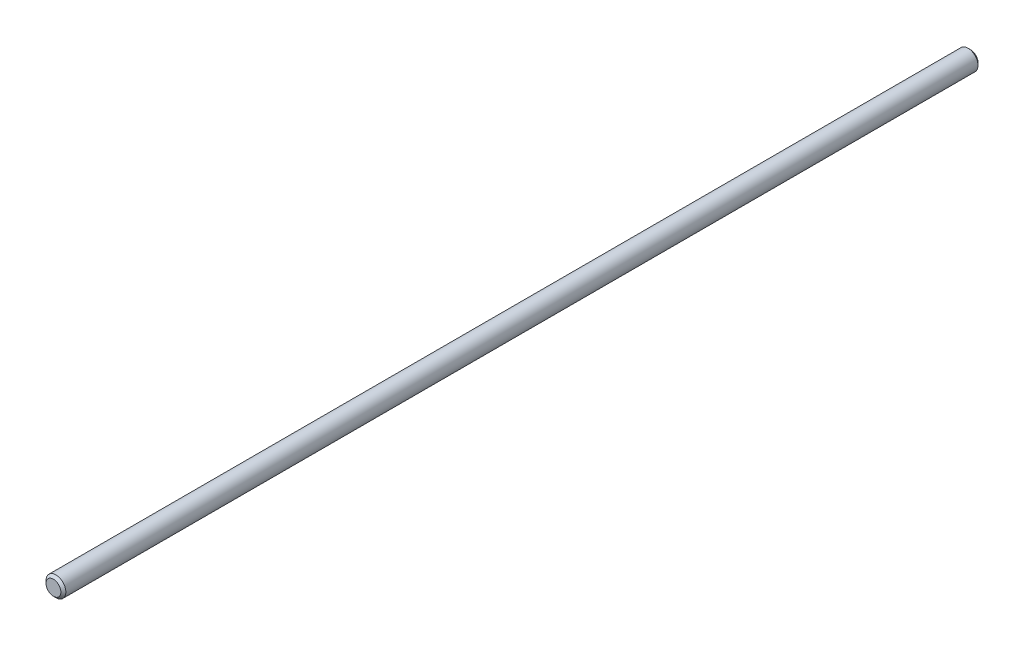
ISO-10303-21;
HEADER;
FILE_DESCRIPTION(('STEP AP214'),'2;1');
FILE_NAME('part.step','',(''),(''),'','','');
FILE_SCHEMA(('AUTOMOTIVE_DESIGN { 1 0 10303 214 1 1 1 1 }'));
ENDSEC;
DATA;
#1=APPLICATION_CONTEXT('core data for automotive mechanical design processes');
#2=APPLICATION_PROTOCOL_DEFINITION('international standard','automotive_design',2000,#1);
#3=PRODUCT_CONTEXT('',#1,'mechanical');
#4=PRODUCT('Part','Part','',(#3));
#5=PRODUCT_RELATED_PRODUCT_CATEGORY('part','',(#4));
#6=PRODUCT_DEFINITION_FORMATION('','',#4);
#7=PRODUCT_DEFINITION_CONTEXT('part definition',#1,'design');
#8=PRODUCT_DEFINITION('design','',#6,#7);
#9=PRODUCT_DEFINITION_SHAPE('','',#8);
#10=(LENGTH_UNIT() NAMED_UNIT(*) SI_UNIT(.MILLI.,.METRE.));
#11=(NAMED_UNIT(*) PLANE_ANGLE_UNIT() SI_UNIT($,.RADIAN.));
#12=(NAMED_UNIT(*) SI_UNIT($,.STERADIAN.) SOLID_ANGLE_UNIT());
#13=UNCERTAINTY_MEASURE_WITH_UNIT(LENGTH_MEASURE(1.E-05),#10,'distance_accuracy_value','');
#14=(GEOMETRIC_REPRESENTATION_CONTEXT(3) GLOBAL_UNCERTAINTY_ASSIGNED_CONTEXT((#13)) GLOBAL_UNIT_ASSIGNED_CONTEXT((#10,
#11,#12)) REPRESENTATION_CONTEXT('',''));
#15=CARTESIAN_POINT('',(0.,0.,0.));
#16=DIRECTION('',(0.,0.,1.));
#17=DIRECTION('',(1.,0.,0.));
#18=AXIS2_PLACEMENT_3D('',#15,#16,#17);
#19=CARTESIAN_POINT('',(0.,0.,370.));
#20=DIRECTION('',(0.,0.,-1.));
#21=DIRECTION('',(-1.,0.,0.));
#22=AXIS2_PLACEMENT_3D('',#19,#20,#21);
#23=CYLINDRICAL_SURFACE('',#22,4.);
#24=CARTESIAN_POINT('',(0.,0.,1.00000000000006));
#25=DIRECTION('',(0.,0.,1.));
#26=DIRECTION('',(1.,0.,0.));
#27=AXIS2_PLACEMENT_3D('',#24,#25,#26);
#28=CIRCLE('',#27,4.);
#29=CARTESIAN_POINT('',(4.,0.,1.00000000000006));
#30=VERTEX_POINT('',#29);
#31=EDGE_CURVE('E46',#30,#30,#28,.T.);
#32=ORIENTED_EDGE('',*,*,#31,.T.);
#33=EDGE_LOOP('',(#32));
#34=FACE_BOUND('',#33,.T.);
#35=CARTESIAN_POINT('',(0.,0.,369.));
#36=DIRECTION('',(0.,0.,1.));
#37=DIRECTION('',(1.,0.,0.));
#38=AXIS2_PLACEMENT_3D('',#35,#36,#37);
#39=CIRCLE('',#38,4.);
#40=CARTESIAN_POINT('',(4.,0.,369.));
#41=VERTEX_POINT('',#40);
#42=EDGE_CURVE('E50',#41,#41,#39,.F.);
#43=ORIENTED_EDGE('',*,*,#42,.T.);
#44=EDGE_LOOP('',(#43));
#45=FACE_BOUND('',#44,.T.);
#46=ADVANCED_FACE('F35',(#34,#45),#23,.T.);
#47=CARTESIAN_POINT('',(0.,0.,370.));
#48=DIRECTION('',(0.,0.,1.));
#49=DIRECTION('',(1.,0.,0.));
#50=AXIS2_PLACEMENT_3D('',#47,#48,#49);
#51=PLANE('',#50);
#52=CARTESIAN_POINT('',(0.,0.,370.));
#53=DIRECTION('',(0.,0.,1.));
#54=DIRECTION('',(1.,0.,0.));
#55=AXIS2_PLACEMENT_3D('',#52,#53,#54);
#56=CIRCLE('',#55,3.);
#57=CARTESIAN_POINT('',(3.,0.,370.));
#58=VERTEX_POINT('',#57);
#59=EDGE_CURVE('E10',#58,#58,#56,.T.);
#60=ORIENTED_EDGE('',*,*,#59,.T.);
#61=EDGE_LOOP('',(#60));
#62=FACE_BOUND('',#61,.T.);
#63=ADVANCED_FACE('F66',(#62),#51,.T.);
#64=CARTESIAN_POINT('',(0.,0.,0.));
#65=DIRECTION('',(0.,0.,1.));
#66=DIRECTION('',(1.,0.,0.));
#67=AXIS2_PLACEMENT_3D('',#64,#65,#66);
#68=PLANE('',#67);
#69=CARTESIAN_POINT('',(0.,0.,0.));
#70=DIRECTION('',(0.,0.,1.));
#71=DIRECTION('',(1.,0.,0.));
#72=AXIS2_PLACEMENT_3D('',#69,#70,#71);
#73=CIRCLE('',#72,2.99999999999995);
#74=CARTESIAN_POINT('',(2.99999999999995,0.,0.));
#75=VERTEX_POINT('',#74);
#76=EDGE_CURVE('E42',#75,#75,#73,.F.);
#77=ORIENTED_EDGE('',*,*,#76,.T.);
#78=EDGE_LOOP('',(#77));
#79=FACE_BOUND('',#78,.T.);
#80=ADVANCED_FACE('F63',(#79),#68,.F.);
#81=CARTESIAN_POINT('',(0.,0.,1.00000000000006));
#82=DIRECTION('',(0.,0.,1.));
#83=DIRECTION('',(1.,0.,0.));
#84=AXIS2_PLACEMENT_3D('',#81,#82,#83);
#85=CONICAL_SURFACE('',#84,4.,0.785398163397447);
#86=ORIENTED_EDGE('',*,*,#76,.F.);
#87=EDGE_LOOP('',(#86));
#88=FACE_BOUND('',#87,.T.);
#89=ORIENTED_EDGE('',*,*,#31,.F.);
#90=EDGE_LOOP('',(#89));
#91=FACE_BOUND('',#90,.T.);
#92=ADVANCED_FACE('F59',(#88,#91),#85,.T.);
#93=CARTESIAN_POINT('',(0.,0.,370.));
#94=DIRECTION('',(0.,0.,-1.));
#95=DIRECTION('',(-1.,0.,0.));
#96=AXIS2_PLACEMENT_3D('',#93,#94,#95);
#97=CONICAL_SURFACE('',#96,3.,0.785398163397447);
#98=ORIENTED_EDGE('',*,*,#42,.F.);
#99=EDGE_LOOP('',(#98));
#100=FACE_BOUND('',#99,.T.);
#101=ORIENTED_EDGE('',*,*,#59,.F.);
#102=EDGE_LOOP('',(#101));
#103=FACE_BOUND('',#102,.T.);
#104=ADVANCED_FACE('F37',(#100,#103),#97,.T.);
#105=CLOSED_SHELL('',(#46,#63,#80,#92,#104));
#106=MANIFOLD_SOLID_BREP('B2',#105);
#107=ADVANCED_BREP_SHAPE_REPRESENTATION('',(#18,#106),#14);
#108=SHAPE_DEFINITION_REPRESENTATION(#9,#107);
ENDSEC;
END-ISO-10303-21;
